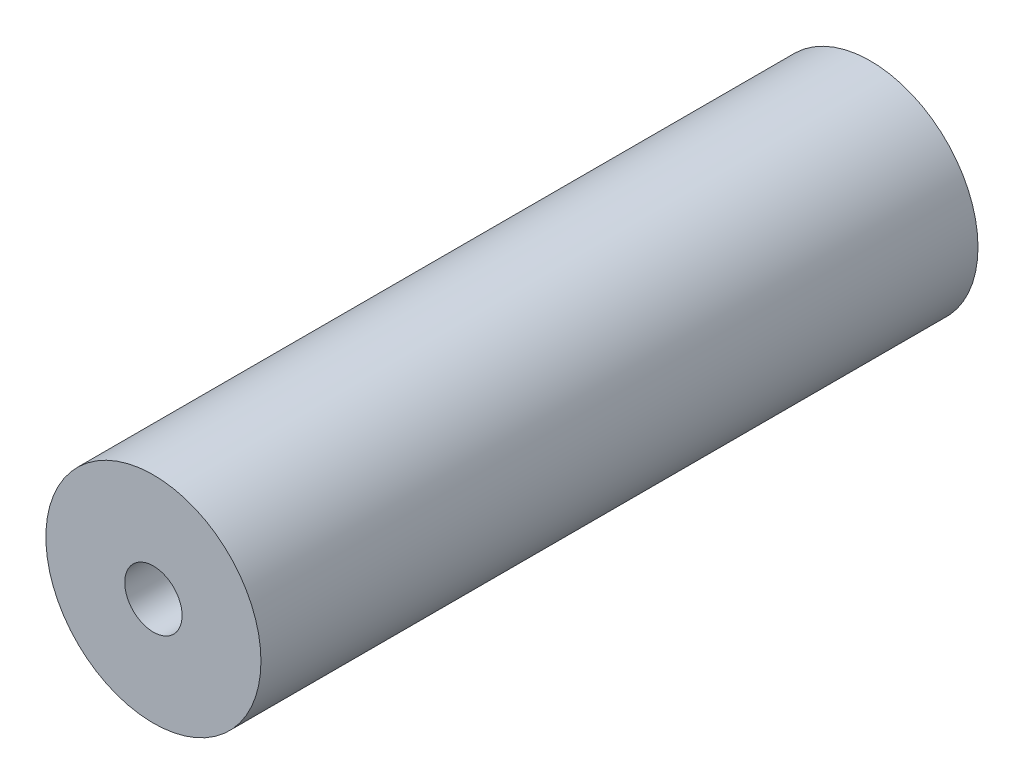
ISO-10303-21;
HEADER;
FILE_DESCRIPTION(('STEP AP214'),'2;1');
FILE_NAME('part.step','',(''),(''),'','','');
FILE_SCHEMA(('AUTOMOTIVE_DESIGN { 1 0 10303 214 1 1 1 1 }'));
ENDSEC;
DATA;
#1=APPLICATION_CONTEXT('core data for automotive mechanical design processes');
#2=APPLICATION_PROTOCOL_DEFINITION('international standard','automotive_design',2000,#1);
#3=PRODUCT_CONTEXT('',#1,'mechanical');
#4=PRODUCT('Part','Part','',(#3));
#5=PRODUCT_RELATED_PRODUCT_CATEGORY('part','',(#4));
#6=PRODUCT_DEFINITION_FORMATION('','',#4);
#7=PRODUCT_DEFINITION_CONTEXT('part definition',#1,'design');
#8=PRODUCT_DEFINITION('design','',#6,#7);
#9=PRODUCT_DEFINITION_SHAPE('','',#8);
#10=(LENGTH_UNIT() NAMED_UNIT(*) SI_UNIT(.MILLI.,.METRE.));
#11=(NAMED_UNIT(*) PLANE_ANGLE_UNIT() SI_UNIT($,.RADIAN.));
#12=(NAMED_UNIT(*) SI_UNIT($,.STERADIAN.) SOLID_ANGLE_UNIT());
#13=UNCERTAINTY_MEASURE_WITH_UNIT(LENGTH_MEASURE(1.E-05),#10,'distance_accuracy_value','');
#14=(GEOMETRIC_REPRESENTATION_CONTEXT(3) GLOBAL_UNCERTAINTY_ASSIGNED_CONTEXT((#13)) GLOBAL_UNIT_ASSIGNED_CONTEXT((#10,
#11,#12)) REPRESENTATION_CONTEXT('',''));
#15=CARTESIAN_POINT('',(0.,0.,0.));
#16=DIRECTION('',(0.,0.,1.));
#17=DIRECTION('',(1.,0.,0.));
#18=AXIS2_PLACEMENT_3D('',#15,#16,#17);
#19=CARTESIAN_POINT('',(0.,0.,10.));
#20=DIRECTION('',(0.,0.,1.));
#21=DIRECTION('',(1.,0.,0.));
#22=AXIS2_PLACEMENT_3D('',#19,#20,#21);
#23=PLANE('',#22);
#24=CARTESIAN_POINT('',(0.,0.,10.));
#25=DIRECTION('',(0.,0.,1.));
#26=DIRECTION('',(1.,0.,0.));
#27=AXIS2_PLACEMENT_3D('',#24,#25,#26);
#28=CIRCLE('',#27,1.5);
#29=CARTESIAN_POINT('',(1.5,0.,10.));
#30=VERTEX_POINT('',#29);
#31=EDGE_CURVE('E10',#30,#30,#28,.T.);
#32=ORIENTED_EDGE('',*,*,#31,.T.);
#33=EDGE_LOOP('',(#32));
#34=FACE_BOUND('',#33,.T.);
#35=CARTESIAN_POINT('',(0.,0.,10.));
#36=DIRECTION('',(0.,0.,1.));
#37=DIRECTION('',(1.,0.,0.));
#38=AXIS2_PLACEMENT_3D('',#35,#36,#37);
#39=CIRCLE('',#38,0.4);
#40=CARTESIAN_POINT('',(0.4,0.,10.));
#41=VERTEX_POINT('',#40);
#42=EDGE_CURVE('E44',#41,#41,#39,.T.);
#43=ORIENTED_EDGE('',*,*,#42,.F.);
#44=EDGE_LOOP('',(#43));
#45=FACE_BOUND('',#44,.T.);
#46=ADVANCED_FACE('F33',(#34,#45),#23,.T.);
#47=CARTESIAN_POINT('',(0.,0.,0.));
#48=DIRECTION('',(0.,0.,1.));
#49=DIRECTION('',(1.,0.,0.));
#50=AXIS2_PLACEMENT_3D('',#47,#48,#49);
#51=PLANE('',#50);
#52=CARTESIAN_POINT('',(0.,0.,0.));
#53=DIRECTION('',(0.,0.,1.));
#54=DIRECTION('',(1.,0.,0.));
#55=AXIS2_PLACEMENT_3D('',#52,#53,#54);
#56=CIRCLE('',#55,1.5);
#57=CARTESIAN_POINT('',(1.5,0.,0.));
#58=VERTEX_POINT('',#57);
#59=EDGE_CURVE('E37',#58,#58,#56,.T.);
#60=ORIENTED_EDGE('',*,*,#59,.F.);
#61=EDGE_LOOP('',(#60));
#62=FACE_BOUND('',#61,.T.);
#63=CARTESIAN_POINT('',(0.,0.,0.));
#64=DIRECTION('',(0.,0.,1.));
#65=DIRECTION('',(1.,0.,0.));
#66=AXIS2_PLACEMENT_3D('',#63,#64,#65);
#67=CIRCLE('',#66,0.4);
#68=CARTESIAN_POINT('',(0.4,0.,0.));
#69=VERTEX_POINT('',#68);
#70=EDGE_CURVE('E46',#69,#69,#67,.T.);
#71=ORIENTED_EDGE('',*,*,#70,.T.);
#72=EDGE_LOOP('',(#71));
#73=FACE_BOUND('',#72,.T.);
#74=ADVANCED_FACE('F56',(#62,#73),#51,.F.);
#75=CARTESIAN_POINT('',(0.,0.,10.));
#76=DIRECTION('',(0.,0.,-1.));
#77=DIRECTION('',(-1.,0.,0.));
#78=AXIS2_PLACEMENT_3D('',#75,#76,#77);
#79=CYLINDRICAL_SURFACE('',#78,1.5);
#80=ORIENTED_EDGE('',*,*,#31,.F.);
#81=EDGE_LOOP('',(#80));
#82=FACE_BOUND('',#81,.T.);
#83=ORIENTED_EDGE('',*,*,#59,.T.);
#84=EDGE_LOOP('',(#83));
#85=FACE_BOUND('',#84,.T.);
#86=ADVANCED_FACE('F35',(#82,#85),#79,.T.);
#87=CARTESIAN_POINT('',(0.,0.,10.));
#88=DIRECTION('',(0.,0.,-1.));
#89=DIRECTION('',(-1.,0.,0.));
#90=AXIS2_PLACEMENT_3D('',#87,#88,#89);
#91=CYLINDRICAL_SURFACE('',#90,0.4);
#92=ORIENTED_EDGE('',*,*,#42,.T.);
#93=EDGE_LOOP('',(#92));
#94=FACE_BOUND('',#93,.T.);
#95=ORIENTED_EDGE('',*,*,#70,.F.);
#96=EDGE_LOOP('',(#95));
#97=FACE_BOUND('',#96,.T.);
#98=ADVANCED_FACE('F52',(#94,#97),#91,.F.);
#99=CLOSED_SHELL('',(#46,#74,#86,#98));
#100=MANIFOLD_SOLID_BREP('B2',#99);
#101=ADVANCED_BREP_SHAPE_REPRESENTATION('',(#18,#100),#14);
#102=SHAPE_DEFINITION_REPRESENTATION(#9,#101);
ENDSEC;
END-ISO-10303-21;
